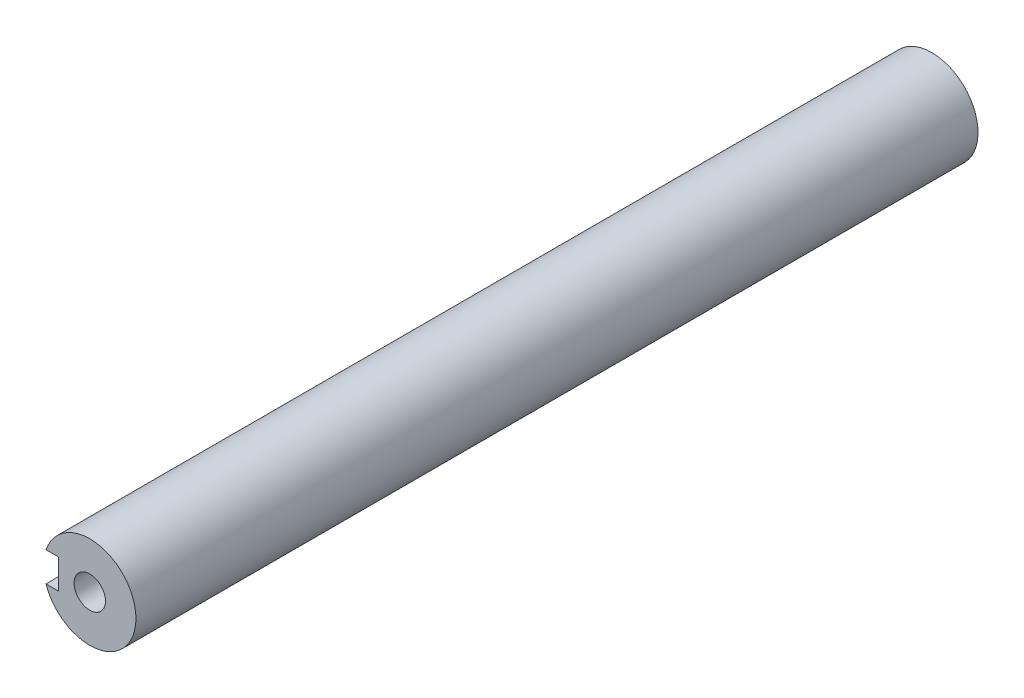
ISO-10303-21;
HEADER;
FILE_DESCRIPTION(('STEP AP214'),'2;1');
FILE_NAME('part.step','',(''),(''),'','','');
FILE_SCHEMA(('AUTOMOTIVE_DESIGN { 1 0 10303 214 1 1 1 1 }'));
ENDSEC;
DATA;
#1=APPLICATION_CONTEXT('core data for automotive mechanical design processes');
#2=APPLICATION_PROTOCOL_DEFINITION('international standard','automotive_design',2000,#1);
#3=PRODUCT_CONTEXT('',#1,'mechanical');
#4=PRODUCT('Part','Part','',(#3));
#5=PRODUCT_RELATED_PRODUCT_CATEGORY('part','',(#4));
#6=PRODUCT_DEFINITION_FORMATION('','',#4);
#7=PRODUCT_DEFINITION_CONTEXT('part definition',#1,'design');
#8=PRODUCT_DEFINITION('design','',#6,#7);
#9=PRODUCT_DEFINITION_SHAPE('','',#8);
#10=(LENGTH_UNIT() NAMED_UNIT(*) SI_UNIT(.MILLI.,.METRE.));
#11=(NAMED_UNIT(*) PLANE_ANGLE_UNIT() SI_UNIT($,.RADIAN.));
#12=(NAMED_UNIT(*) SI_UNIT($,.STERADIAN.) SOLID_ANGLE_UNIT());
#13=UNCERTAINTY_MEASURE_WITH_UNIT(LENGTH_MEASURE(1.E-05),#10,'distance_accuracy_value','');
#14=(GEOMETRIC_REPRESENTATION_CONTEXT(3) GLOBAL_UNCERTAINTY_ASSIGNED_CONTEXT((#13)) GLOBAL_UNIT_ASSIGNED_CONTEXT((#10,
#11,#12)) REPRESENTATION_CONTEXT('',''));
#15=CARTESIAN_POINT('',(0.,0.,0.));
#16=DIRECTION('',(0.,0.,1.));
#17=DIRECTION('',(1.,0.,0.));
#18=AXIS2_PLACEMENT_3D('',#15,#16,#17);
#19=CARTESIAN_POINT('',(-9.92808228585148,-179.837413039642,-229.4));
#20=DIRECTION('',(0.,0.,-1.));
#21=DIRECTION('',(0.381849318686592,0.924224592736303,0.));
#22=AXIS2_PLACEMENT_3D('',#19,#20,#21);
#23=PLANE('',#22);
#24=CARTESIAN_POINT('',(0.192463073773047,-155.807573628499,-229.4));
#25=DIRECTION('',(0.,0.,-1.));
#26=DIRECTION('',(0.,1.,0.));
#27=AXIS2_PLACEMENT_3D('',#24,#25,#26);
#28=CIRCLE('',#27,4.24999999999999);
#29=CARTESIAN_POINT('',(0.192463073773047,-151.557573628499,-229.4));
#30=VERTEX_POINT('',#29);
#31=EDGE_CURVE('E108',#30,#30,#28,.T.);
#32=ORIENTED_EDGE('',*,*,#31,.F.);
#33=EDGE_LOOP('',(#32));
#34=FACE_BOUND('',#33,.T.);
#35=CARTESIAN_POINT('',(0.192463073773047,-155.807573628499,-229.4));
#36=DIRECTION('',(0.,0.,-1.));
#37=DIRECTION('',(0.,1.,0.));
#38=AXIS2_PLACEMENT_3D('',#35,#36,#37);
#39=CIRCLE('',#38,12.5);
#40=CARTESIAN_POINT('',(0.192463073773047,-143.307573628499,-229.4));
#41=VERTEX_POINT('',#40);
#42=EDGE_CURVE('E124',#41,#41,#39,.F.);
#43=ORIENTED_EDGE('',*,*,#42,.F.);
#44=EDGE_LOOP('',(#43));
#45=FACE_BOUND('',#44,.T.);
#46=ADVANCED_FACE('F39',(#34,#45),#23,.T.);
#47=CARTESIAN_POINT('',(0.192463073773047,-155.807573628499,-1.5));
#48=DIRECTION('',(0.,0.,1.));
#49=DIRECTION('',(1.,0.,0.));
#50=AXIS2_PLACEMENT_3D('',#47,#48,#49);
#51=PLANE('',#50);
#52=DIRECTION('',(1.,0.,0.));
#53=VECTOR('',#52,1.);
#54=CARTESIAN_POINT('',(-16.307536926227,-159.807573628499,-1.5));
#55=LINE('',#54,#53);
#56=CARTESIAN_POINT('',(-11.650256208554,-159.807573628499,-1.5));
#57=VERTEX_POINT('',#56);
#58=CARTESIAN_POINT('',(-8.30753692622698,-159.807573628499,-1.5));
#59=VERTEX_POINT('',#58);
#60=EDGE_CURVE('E100',#57,#59,#55,.T.);
#61=ORIENTED_EDGE('',*,*,#60,.F.);
#62=CARTESIAN_POINT('',(0.192463073773047,-155.807573628499,-1.5));
#63=DIRECTION('',(0.,0.,1.));
#64=DIRECTION('',(1.,0.,0.));
#65=AXIS2_PLACEMENT_3D('',#62,#63,#64);
#66=CIRCLE('',#65,12.5);
#67=CARTESIAN_POINT('',(-11.650256208554,-151.807573628499,-1.5));
#68=VERTEX_POINT('',#67);
#69=EDGE_CURVE('E121',#57,#68,#66,.T.);
#70=ORIENTED_EDGE('',*,*,#69,.T.);
#71=DIRECTION('',(-1.,0.,0.));
#72=VECTOR('',#71,1.);
#73=CARTESIAN_POINT('',(-16.307536926227,-151.807573628499,-1.5));
#74=LINE('',#73,#72);
#75=CARTESIAN_POINT('',(-8.30753692622698,-151.807573628499,-1.5));
#76=VERTEX_POINT('',#75);
#77=EDGE_CURVE('E102',#76,#68,#74,.T.);
#78=ORIENTED_EDGE('',*,*,#77,.F.);
#79=DIRECTION('',(0.,1.,0.));
#80=VECTOR('',#79,1.);
#81=CARTESIAN_POINT('',(-8.30753692622698,-159.807573628499,-1.5));
#82=LINE('',#81,#80);
#83=EDGE_CURVE('E87',#59,#76,#82,.T.);
#84=ORIENTED_EDGE('',*,*,#83,.F.);
#85=EDGE_LOOP('',(#61,#70,#78,#84));
#86=FACE_BOUND('',#85,.T.);
#87=CARTESIAN_POINT('',(0.192463073773047,-155.807573628499,-1.5));
#88=DIRECTION('',(0.,0.,1.));
#89=DIRECTION('',(1.,0.,0.));
#90=AXIS2_PLACEMENT_3D('',#87,#88,#89);
#91=CIRCLE('',#90,4.24999999999999);
#92=CARTESIAN_POINT('',(4.44246307377304,-155.807573628499,-1.5));
#93=VERTEX_POINT('',#92);
#94=EDGE_CURVE('E115',#93,#93,#91,.T.);
#95=ORIENTED_EDGE('',*,*,#94,.F.);
#96=EDGE_LOOP('',(#95));
#97=FACE_BOUND('',#96,.T.);
#98=ADVANCED_FACE('F137',(#86,#97),#51,.T.);
#99=CARTESIAN_POINT('',(0.192463073773047,-155.807573628499,-266.255339059327));
#100=DIRECTION('',(0.,0.,1.));
#101=DIRECTION('',(1.,0.,0.));
#102=AXIS2_PLACEMENT_3D('',#99,#100,#101);
#103=CYLINDRICAL_SURFACE('',#102,12.5);
#104=DIRECTION('',(0.,0.,1.));
#105=VECTOR('',#104,1.);
#106=CARTESIAN_POINT('',(-11.650256208554,-159.807573628499,-266.255339059327));
#107=LINE('',#106,#105);
#108=CARTESIAN_POINT('',(-11.650256208554,-159.807573628499,-31.5));
#109=VERTEX_POINT('',#108);
#110=EDGE_CURVE('E11',#109,#57,#107,.T.);
#111=ORIENTED_EDGE('',*,*,#110,.F.);
#112=CARTESIAN_POINT('',(0.192463073773047,-155.807573628499,-31.5));
#113=DIRECTION('',(0.,0.,-1.));
#114=DIRECTION('',(-1.,0.,0.));
#115=AXIS2_PLACEMENT_3D('',#112,#113,#114);
#116=CIRCLE('',#115,12.5);
#117=CARTESIAN_POINT('',(-11.650256208554,-151.807573628499,-31.5));
#118=VERTEX_POINT('',#117);
#119=EDGE_CURVE('E127',#118,#109,#116,.F.);
#120=ORIENTED_EDGE('',*,*,#119,.F.);
#121=DIRECTION('',(0.,0.,1.));
#122=VECTOR('',#121,1.);
#123=CARTESIAN_POINT('',(-11.650256208554,-151.807573628499,-266.255339059327));
#124=LINE('',#123,#122);
#125=EDGE_CURVE('E46',#68,#118,#124,.F.);
#126=ORIENTED_EDGE('',*,*,#125,.F.);
#127=ORIENTED_EDGE('',*,*,#69,.F.);
#128=EDGE_LOOP('',(#111,#120,#126,#127));
#129=FACE_BOUND('',#128,.T.);
#130=ORIENTED_EDGE('',*,*,#42,.T.);
#131=EDGE_LOOP('',(#130));
#132=FACE_BOUND('',#131,.T.);
#133=ADVANCED_FACE('F134',(#129,#132),#103,.T.);
#134=CARTESIAN_POINT('',(0.192463073773047,-155.807573628499,-31.5));
#135=DIRECTION('',(0.,0.,1.));
#136=DIRECTION('',(1.,0.,0.));
#137=AXIS2_PLACEMENT_3D('',#134,#135,#136);
#138=CONICAL_SURFACE('',#137,4.24999999999999,1.02974425867665);
#139=CARTESIAN_POINT('',(0.192463073773039,-155.807573628499,-34.0536576308671));
#140=VERTEX_POINT('',#139);
#141=VERTEX_LOOP('',#140);
#142=FACE_BOUND('',#141,.T.);
#143=CARTESIAN_POINT('',(0.192463073773047,-155.807573628499,-31.5));
#144=DIRECTION('',(0.,0.,1.));
#145=DIRECTION('',(1.,0.,0.));
#146=AXIS2_PLACEMENT_3D('',#143,#144,#145);
#147=CIRCLE('',#146,4.24999999999999);
#148=CARTESIAN_POINT('',(4.44246307377304,-155.807573628499,-31.5));
#149=VERTEX_POINT('',#148);
#150=EDGE_CURVE('E118',#149,#149,#147,.T.);
#151=ORIENTED_EDGE('',*,*,#150,.T.);
#152=EDGE_LOOP('',(#151));
#153=FACE_BOUND('',#152,.T.);
#154=ADVANCED_FACE('F146',(#142,#153),#138,.F.);
#155=CARTESIAN_POINT('',(0.192463073773047,-155.807573628499,-1.5));
#156=DIRECTION('',(0.,0.,1.));
#157=DIRECTION('',(1.,0.,0.));
#158=AXIS2_PLACEMENT_3D('',#155,#156,#157);
#159=CYLINDRICAL_SURFACE('',#158,4.24999999999999);
#160=ORIENTED_EDGE('',*,*,#150,.F.);
#161=EDGE_LOOP('',(#160));
#162=FACE_BOUND('',#161,.T.);
#163=ORIENTED_EDGE('',*,*,#94,.T.);
#164=EDGE_LOOP('',(#163));
#165=FACE_BOUND('',#164,.T.);
#166=ADVANCED_FACE('F143',(#162,#165),#159,.F.);
#167=CARTESIAN_POINT('',(0.192463073773047,-155.807573628499,-196.9));
#168=DIRECTION('',(0.,0.,-1.));
#169=DIRECTION('',(0.,1.,0.));
#170=AXIS2_PLACEMENT_3D('',#167,#168,#169);
#171=CONICAL_SURFACE('',#170,4.24999999999999,1.02974425867665);
#172=CARTESIAN_POINT('',(0.192463073773038,-155.807573628499,-194.346342369133));
#173=VERTEX_POINT('',#172);
#174=VERTEX_LOOP('',#173);
#175=FACE_BOUND('',#174,.T.);
#176=CARTESIAN_POINT('',(0.192463073773047,-155.807573628499,-196.9));
#177=DIRECTION('',(0.,0.,-1.));
#178=DIRECTION('',(0.,1.,0.));
#179=AXIS2_PLACEMENT_3D('',#176,#177,#178);
#180=CIRCLE('',#179,4.24999999999999);
#181=CARTESIAN_POINT('',(0.192463073773047,-151.557573628499,-196.9));
#182=VERTEX_POINT('',#181);
#183=EDGE_CURVE('E112',#182,#182,#180,.T.);
#184=ORIENTED_EDGE('',*,*,#183,.T.);
#185=EDGE_LOOP('',(#184));
#186=FACE_BOUND('',#185,.T.);
#187=ADVANCED_FACE('F145',(#175,#186),#171,.F.);
#188=CARTESIAN_POINT('',(0.192463073773047,-155.807573628499,-229.4));
#189=DIRECTION('',(0.,0.,-1.));
#190=DIRECTION('',(0.,1.,0.));
#191=AXIS2_PLACEMENT_3D('',#188,#189,#190);
#192=CYLINDRICAL_SURFACE('',#191,4.24999999999999);
#193=ORIENTED_EDGE('',*,*,#183,.F.);
#194=EDGE_LOOP('',(#193));
#195=FACE_BOUND('',#194,.T.);
#196=ORIENTED_EDGE('',*,*,#31,.T.);
#197=EDGE_LOOP('',(#196));
#198=FACE_BOUND('',#197,.T.);
#199=ADVANCED_FACE('F153',(#195,#198),#192,.F.);
#200=CARTESIAN_POINT('',(-8.30753692622698,-159.807573628499,-31.5));
#201=DIRECTION('',(1.,0.,0.));
#202=DIRECTION('',(0.,0.,-1.));
#203=AXIS2_PLACEMENT_3D('',#200,#201,#202);
#204=PLANE('',#203);
#205=ORIENTED_EDGE('',*,*,#83,.T.);
#206=DIRECTION('',(0.,0.,1.));
#207=VECTOR('',#206,1.);
#208=CARTESIAN_POINT('',(-8.30753692622698,-151.807573628499,-31.5));
#209=LINE('',#208,#207);
#210=CARTESIAN_POINT('',(-8.30753692622698,-151.807573628499,-31.5));
#211=VERTEX_POINT('',#210);
#212=EDGE_CURVE('E82',#211,#76,#209,.T.);
#213=ORIENTED_EDGE('',*,*,#212,.F.);
#214=DIRECTION('',(0.,1.,0.));
#215=VECTOR('',#214,1.);
#216=CARTESIAN_POINT('',(-8.30753692622698,-159.807573628499,-31.5));
#217=LINE('',#216,#215);
#218=CARTESIAN_POINT('',(-8.30753692622698,-159.807573628499,-31.5));
#219=VERTEX_POINT('',#218);
#220=EDGE_CURVE('E85',#219,#211,#217,.T.);
#221=ORIENTED_EDGE('',*,*,#220,.F.);
#222=DIRECTION('',(0.,0.,1.));
#223=VECTOR('',#222,1.);
#224=CARTESIAN_POINT('',(-8.30753692622698,-159.807573628499,-31.5));
#225=LINE('',#224,#223);
#226=EDGE_CURVE('E90',#219,#59,#225,.T.);
#227=ORIENTED_EDGE('',*,*,#226,.T.);
#228=EDGE_LOOP('',(#205,#213,#221,#227));
#229=FACE_BOUND('',#228,.T.);
#230=ADVANCED_FACE('F83',(#229),#204,.F.);
#231=CARTESIAN_POINT('',(-16.307536926227,-159.807573628499,-31.5));
#232=DIRECTION('',(0.,-1.,0.));
#233=DIRECTION('',(0.,0.,-1.));
#234=AXIS2_PLACEMENT_3D('',#231,#232,#233);
#235=PLANE('',#234);
#236=ORIENTED_EDGE('',*,*,#110,.T.);
#237=ORIENTED_EDGE('',*,*,#60,.T.);
#238=ORIENTED_EDGE('',*,*,#226,.F.);
#239=DIRECTION('',(1.,0.,0.));
#240=VECTOR('',#239,1.);
#241=CARTESIAN_POINT('',(-16.307536926227,-159.807573628499,-31.5));
#242=LINE('',#241,#240);
#243=EDGE_CURVE('E91',#109,#219,#242,.T.);
#244=ORIENTED_EDGE('',*,*,#243,.F.);
#245=EDGE_LOOP('',(#236,#237,#238,#244));
#246=FACE_BOUND('',#245,.T.);
#247=ADVANCED_FACE('F131',(#246),#235,.F.);
#248=CARTESIAN_POINT('',(-16.307536926227,-151.807573628499,-31.5));
#249=DIRECTION('',(0.,1.,0.));
#250=DIRECTION('',(0.,0.,1.));
#251=AXIS2_PLACEMENT_3D('',#248,#249,#250);
#252=PLANE('',#251);
#253=ORIENTED_EDGE('',*,*,#125,.T.);
#254=DIRECTION('',(-1.,0.,0.));
#255=VECTOR('',#254,1.);
#256=CARTESIAN_POINT('',(-16.307536926227,-151.807573628499,-31.5));
#257=LINE('',#256,#255);
#258=EDGE_CURVE('E53',#211,#118,#257,.T.);
#259=ORIENTED_EDGE('',*,*,#258,.F.);
#260=ORIENTED_EDGE('',*,*,#212,.T.);
#261=ORIENTED_EDGE('',*,*,#77,.T.);
#262=EDGE_LOOP('',(#253,#259,#260,#261));
#263=FACE_BOUND('',#262,.T.);
#264=ADVANCED_FACE('F93',(#263),#252,.F.);
#265=CARTESIAN_POINT('',(0.,0.,-31.5));
#266=DIRECTION('',(0.,0.,-1.));
#267=DIRECTION('',(-1.,0.,0.));
#268=AXIS2_PLACEMENT_3D('',#265,#266,#267);
#269=PLANE('',#268);
#270=ORIENTED_EDGE('',*,*,#119,.T.);
#271=ORIENTED_EDGE('',*,*,#243,.T.);
#272=ORIENTED_EDGE('',*,*,#220,.T.);
#273=ORIENTED_EDGE('',*,*,#258,.T.);
#274=EDGE_LOOP('',(#270,#271,#272,#273));
#275=FACE_BOUND('',#274,.T.);
#276=ADVANCED_FACE('F97',(#275),#269,.F.);
#277=CLOSED_SHELL('',(#46,#98,#133,#154,#166,#187,#199,#230,#247,#264,#276));
#278=MANIFOLD_SOLID_BREP('B2',#277);
#279=ADVANCED_BREP_SHAPE_REPRESENTATION('',(#18,#278),#14);
#280=SHAPE_DEFINITION_REPRESENTATION(#9,#279);
ENDSEC;
END-ISO-10303-21;
